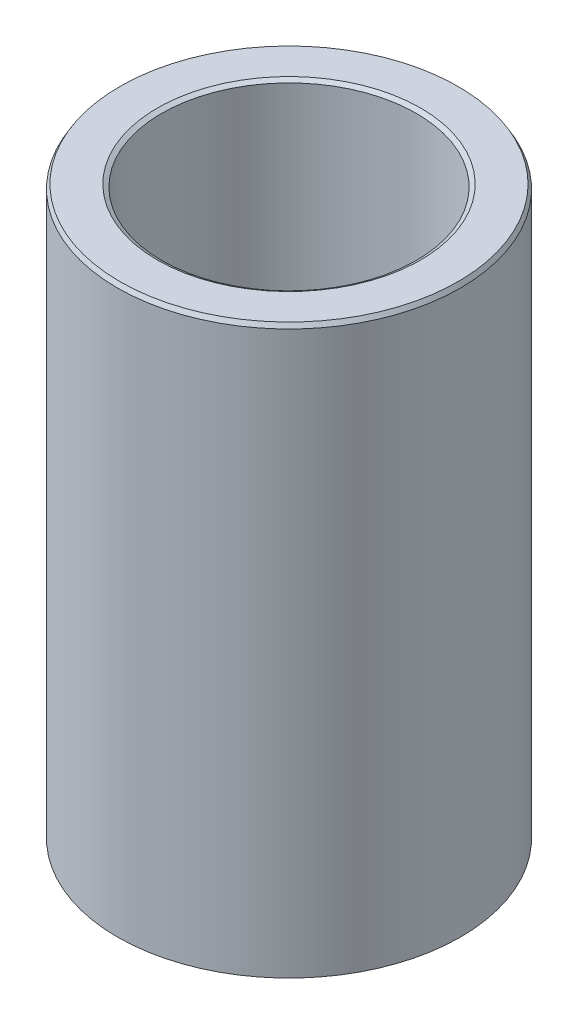
ISO-10303-21;
HEADER;
FILE_DESCRIPTION(('STEP AP214'),'2;1');
FILE_NAME('part.step','',(''),(''),'','','');
FILE_SCHEMA(('AUTOMOTIVE_DESIGN { 1 0 10303 214 1 1 1 1 }'));
ENDSEC;
DATA;
#1=APPLICATION_CONTEXT('core data for automotive mechanical design processes');
#2=APPLICATION_PROTOCOL_DEFINITION('international standard','automotive_design',2000,#1);
#3=PRODUCT_CONTEXT('',#1,'mechanical');
#4=PRODUCT('Part','Part','',(#3));
#5=PRODUCT_RELATED_PRODUCT_CATEGORY('part','',(#4));
#6=PRODUCT_DEFINITION_FORMATION('','',#4);
#7=PRODUCT_DEFINITION_CONTEXT('part definition',#1,'design');
#8=PRODUCT_DEFINITION('design','',#6,#7);
#9=PRODUCT_DEFINITION_SHAPE('','',#8);
#10=(LENGTH_UNIT() NAMED_UNIT(*) SI_UNIT(.MILLI.,.METRE.));
#11=(NAMED_UNIT(*) PLANE_ANGLE_UNIT() SI_UNIT($,.RADIAN.));
#12=(NAMED_UNIT(*) SI_UNIT($,.STERADIAN.) SOLID_ANGLE_UNIT());
#13=UNCERTAINTY_MEASURE_WITH_UNIT(LENGTH_MEASURE(1.E-05),#10,'distance_accuracy_value','');
#14=(GEOMETRIC_REPRESENTATION_CONTEXT(3) GLOBAL_UNCERTAINTY_ASSIGNED_CONTEXT((#13)) GLOBAL_UNIT_ASSIGNED_CONTEXT((#10,
#11,#12)) REPRESENTATION_CONTEXT('',''));
#15=CARTESIAN_POINT('',(0.,0.,0.));
#16=DIRECTION('',(0.,0.,1.));
#17=DIRECTION('',(1.,0.,0.));
#18=AXIS2_PLACEMENT_3D('',#15,#16,#17);
#19=CARTESIAN_POINT('',(0.,99.492693561453,0.));
#20=DIRECTION('',(0.,-1.,0.));
#21=DIRECTION('',(0.,0.,-1.));
#22=AXIS2_PLACEMENT_3D('',#19,#20,#21);
#23=CYLINDRICAL_SURFACE('',#22,30.);
#24=CARTESIAN_POINT('',(0.,0.433209069749835,0.));
#25=DIRECTION('',(0.,1.,0.));
#26=DIRECTION('',(0.,0.,1.));
#27=AXIS2_PLACEMENT_3D('',#24,#25,#26);
#28=CIRCLE('',#27,30.);
#29=CARTESIAN_POINT('',(0.,0.433209069749835,30.));
#30=VERTEX_POINT('',#29);
#31=EDGE_CURVE('E10',#30,#30,#28,.T.);
#32=ORIENTED_EDGE('',*,*,#31,.T.);
#33=EDGE_LOOP('',(#32));
#34=FACE_BOUND('',#33,.T.);
#35=CARTESIAN_POINT('',(0.,98.7423534423465,0.));
#36=DIRECTION('',(0.,1.,0.));
#37=DIRECTION('',(0.,0.,1.));
#38=AXIS2_PLACEMENT_3D('',#35,#36,#37);
#39=CIRCLE('',#38,30.);
#40=CARTESIAN_POINT('',(0.,98.7423534423465,30.));
#41=VERTEX_POINT('',#40);
#42=EDGE_CURVE('E50',#41,#41,#39,.F.);
#43=ORIENTED_EDGE('',*,*,#42,.T.);
#44=EDGE_LOOP('',(#43));
#45=FACE_BOUND('',#44,.T.);
#46=ADVANCED_FACE('F39',(#34,#45),#23,.T.);
#47=CARTESIAN_POINT('',(0.,99.492693561453,0.));
#48=DIRECTION('',(0.,1.,0.));
#49=DIRECTION('',(0.,0.,1.));
#50=AXIS2_PLACEMENT_3D('',#47,#48,#49);
#51=PLANE('',#50);
#52=CARTESIAN_POINT('',(0.,99.492693561453,0.));
#53=DIRECTION('',(0.,1.,0.));
#54=DIRECTION('',(0.,0.,1.));
#55=AXIS2_PLACEMENT_3D('',#52,#53,#54);
#56=CIRCLE('',#55,23.0258138836295);
#57=CARTESIAN_POINT('',(0.,99.492693561453,23.0258138836295));
#58=VERTEX_POINT('',#57);
#59=EDGE_CURVE('E58',#58,#58,#56,.F.);
#60=ORIENTED_EDGE('',*,*,#59,.T.);
#61=EDGE_LOOP('',(#60));
#62=FACE_BOUND('',#61,.T.);
#63=CARTESIAN_POINT('',(0.,99.492693561453,0.));
#64=DIRECTION('',(0.,1.,0.));
#65=DIRECTION('',(0.,0.,1.));
#66=AXIS2_PLACEMENT_3D('',#63,#64,#65);
#67=CIRCLE('',#66,29.5667909302501);
#68=CARTESIAN_POINT('',(0.,99.492693561453,29.5667909302501));
#69=VERTEX_POINT('',#68);
#70=EDGE_CURVE('E61',#69,#69,#67,.T.);
#71=ORIENTED_EDGE('',*,*,#70,.T.);
#72=EDGE_LOOP('',(#71));
#73=FACE_BOUND('',#72,.T.);
#74=ADVANCED_FACE('F88',(#62,#73),#51,.T.);
#75=CARTESIAN_POINT('',(0.,0.,0.));
#76=DIRECTION('',(0.,1.,0.));
#77=DIRECTION('',(0.,0.,1.));
#78=AXIS2_PLACEMENT_3D('',#75,#76,#77);
#79=PLANE('',#78);
#80=CARTESIAN_POINT('',(0.,0.,0.));
#81=DIRECTION('',(0.,1.,0.));
#82=DIRECTION('',(0.,0.,1.));
#83=AXIS2_PLACEMENT_3D('',#80,#81,#82);
#84=CIRCLE('',#83,22.708682834273);
#85=CARTESIAN_POINT('',(0.,0.,22.708682834273));
#86=VERTEX_POINT('',#85);
#87=EDGE_CURVE('E51',#86,#86,#84,.T.);
#88=ORIENTED_EDGE('',*,*,#87,.T.);
#89=EDGE_LOOP('',(#88));
#90=FACE_BOUND('',#89,.T.);
#91=CARTESIAN_POINT('',(0.,0.,0.));
#92=DIRECTION('',(0.,1.,0.));
#93=DIRECTION('',(0.,0.,1.));
#94=AXIS2_PLACEMENT_3D('',#91,#92,#93);
#95=CIRCLE('',#94,29.2496598808936);
#96=CARTESIAN_POINT('',(0.,0.,29.2496598808936));
#97=VERTEX_POINT('',#96);
#98=EDGE_CURVE('E54',#97,#97,#95,.F.);
#99=ORIENTED_EDGE('',*,*,#98,.T.);
#100=EDGE_LOOP('',(#99));
#101=FACE_BOUND('',#100,.T.);
#102=ADVANCED_FACE('F83',(#90,#101),#79,.F.);
#103=CARTESIAN_POINT('',(0.,99.492693561453,0.));
#104=DIRECTION('',(0.,-1.,0.));
#105=DIRECTION('',(0.,0.,-1.));
#106=AXIS2_PLACEMENT_3D('',#103,#104,#105);
#107=CYLINDRICAL_SURFACE('',#106,22.2754737645232);
#108=CARTESIAN_POINT('',(0.,99.0594844917031,0.));
#109=DIRECTION('',(0.,1.,0.));
#110=DIRECTION('',(0.,0.,1.));
#111=AXIS2_PLACEMENT_3D('',#108,#109,#110);
#112=CIRCLE('',#111,22.2754737645232);
#113=CARTESIAN_POINT('',(0.,99.0594844917031,22.2754737645232));
#114=VERTEX_POINT('',#113);
#115=EDGE_CURVE('E67',#114,#114,#112,.T.);
#116=ORIENTED_EDGE('',*,*,#115,.T.);
#117=EDGE_LOOP('',(#116));
#118=FACE_BOUND('',#117,.T.);
#119=CARTESIAN_POINT('',(0.,0.750340119106394,0.));
#120=DIRECTION('',(0.,1.,0.));
#121=DIRECTION('',(0.,0.,1.));
#122=AXIS2_PLACEMENT_3D('',#119,#120,#121);
#123=CIRCLE('',#122,22.2754737645232);
#124=CARTESIAN_POINT('',(0.,0.750340119106394,22.2754737645232));
#125=VERTEX_POINT('',#124);
#126=EDGE_CURVE('E69',#125,#125,#123,.F.);
#127=ORIENTED_EDGE('',*,*,#126,.T.);
#128=EDGE_LOOP('',(#127));
#129=FACE_BOUND('',#128,.T.);
#130=ADVANCED_FACE('F71',(#118,#129),#107,.F.);
#131=CARTESIAN_POINT('',(0.,99.0594844917031,0.));
#132=DIRECTION('',(0.,1.,0.));
#133=DIRECTION('',(0.,0.,1.));
#134=AXIS2_PLACEMENT_3D('',#131,#132,#133);
#135=CONICAL_SURFACE('',#134,22.2754737645232,1.04719755119661);
#136=ORIENTED_EDGE('',*,*,#59,.F.);
#137=EDGE_LOOP('',(#136));
#138=FACE_BOUND('',#137,.T.);
#139=ORIENTED_EDGE('',*,*,#115,.F.);
#140=EDGE_LOOP('',(#139));
#141=FACE_BOUND('',#140,.T.);
#142=ADVANCED_FACE('F77',(#138,#141),#135,.F.);
#143=CARTESIAN_POINT('',(0.,0.,0.));
#144=DIRECTION('',(0.,-1.,0.));
#145=DIRECTION('',(0.,0.,-1.));
#146=AXIS2_PLACEMENT_3D('',#143,#144,#145);
#147=CONICAL_SURFACE('',#146,22.708682834273,0.523598775598299);
#148=ORIENTED_EDGE('',*,*,#126,.F.);
#149=EDGE_LOOP('',(#148));
#150=FACE_BOUND('',#149,.T.);
#151=ORIENTED_EDGE('',*,*,#87,.F.);
#152=EDGE_LOOP('',(#151));
#153=FACE_BOUND('',#152,.T.);
#154=ADVANCED_FACE('F73',(#150,#153),#147,.F.);
#155=CARTESIAN_POINT('',(0.,0.433209069749835,0.));
#156=DIRECTION('',(0.,1.,0.));
#157=DIRECTION('',(0.,0.,1.));
#158=AXIS2_PLACEMENT_3D('',#155,#156,#157);
#159=CONICAL_SURFACE('',#158,30.,1.0471975511966);
#160=ORIENTED_EDGE('',*,*,#98,.F.);
#161=EDGE_LOOP('',(#160));
#162=FACE_BOUND('',#161,.T.);
#163=ORIENTED_EDGE('',*,*,#31,.F.);
#164=EDGE_LOOP('',(#163));
#165=FACE_BOUND('',#164,.T.);
#166=ADVANCED_FACE('F76',(#162,#165),#159,.T.);
#167=CARTESIAN_POINT('',(0.,99.492693561453,0.));
#168=DIRECTION('',(0.,-1.,0.));
#169=DIRECTION('',(0.,0.,-1.));
#170=AXIS2_PLACEMENT_3D('',#167,#168,#169);
#171=CONICAL_SURFACE('',#170,29.5667909302501,0.523598775598297);
#172=ORIENTED_EDGE('',*,*,#42,.F.);
#173=EDGE_LOOP('',(#172));
#174=FACE_BOUND('',#173,.T.);
#175=ORIENTED_EDGE('',*,*,#70,.F.);
#176=EDGE_LOOP('',(#175));
#177=FACE_BOUND('',#176,.T.);
#178=ADVANCED_FACE('F45',(#174,#177),#171,.T.);
#179=CLOSED_SHELL('',(#46,#74,#102,#130,#142,#154,#166,#178));
#180=MANIFOLD_SOLID_BREP('B2',#179);
#181=ADVANCED_BREP_SHAPE_REPRESENTATION('',(#18,#180),#14);
#182=SHAPE_DEFINITION_REPRESENTATION(#9,#181);
ENDSEC;
END-ISO-10303-21;
